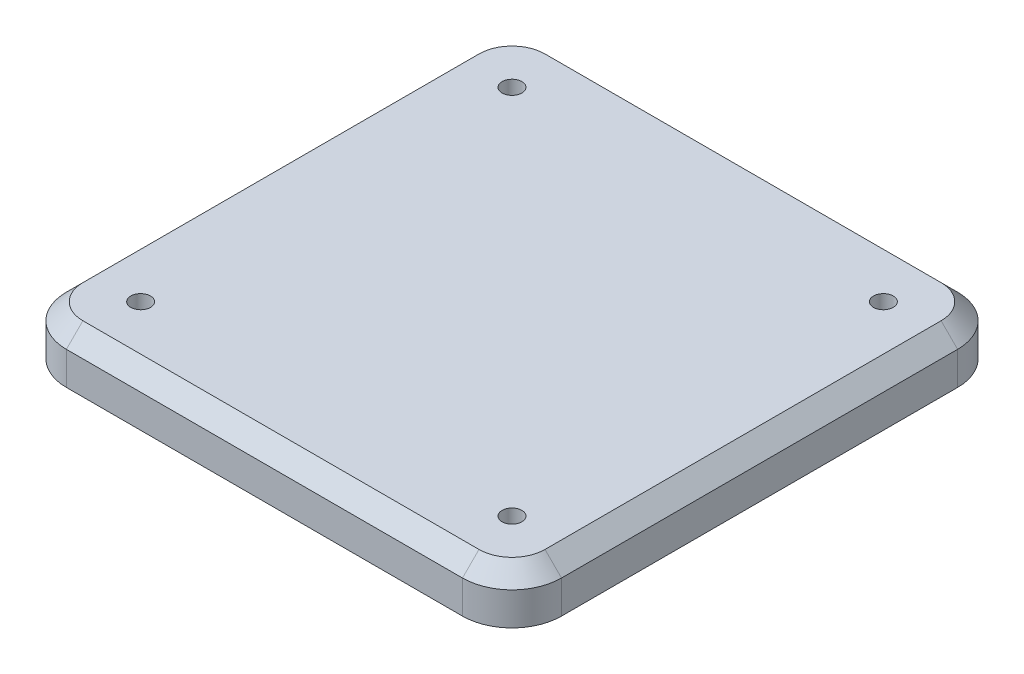
ISO-10303-21;
HEADER;
FILE_DESCRIPTION(('STEP AP214'),'2;1');
FILE_NAME('part.step','',(''),(''),'','','');
FILE_SCHEMA(('AUTOMOTIVE_DESIGN { 1 0 10303 214 1 1 1 1 }'));
ENDSEC;
DATA;
#1=APPLICATION_CONTEXT('core data for automotive mechanical design processes');
#2=APPLICATION_PROTOCOL_DEFINITION('international standard','automotive_design',2000,#1);
#3=PRODUCT_CONTEXT('',#1,'mechanical');
#4=PRODUCT('Part','Part','',(#3));
#5=PRODUCT_RELATED_PRODUCT_CATEGORY('part','',(#4));
#6=PRODUCT_DEFINITION_FORMATION('','',#4);
#7=PRODUCT_DEFINITION_CONTEXT('part definition',#1,'design');
#8=PRODUCT_DEFINITION('design','',#6,#7);
#9=PRODUCT_DEFINITION_SHAPE('','',#8);
#10=(LENGTH_UNIT() NAMED_UNIT(*) SI_UNIT(.MILLI.,.METRE.));
#11=(NAMED_UNIT(*) PLANE_ANGLE_UNIT() SI_UNIT($,.RADIAN.));
#12=(NAMED_UNIT(*) SI_UNIT($,.STERADIAN.) SOLID_ANGLE_UNIT());
#13=UNCERTAINTY_MEASURE_WITH_UNIT(LENGTH_MEASURE(1.E-05),#10,'distance_accuracy_value','');
#14=(GEOMETRIC_REPRESENTATION_CONTEXT(3) GLOBAL_UNCERTAINTY_ASSIGNED_CONTEXT((#13)) GLOBAL_UNIT_ASSIGNED_CONTEXT((#10,
#11,#12)) REPRESENTATION_CONTEXT('',''));
#15=CARTESIAN_POINT('',(0.,0.,0.));
#16=DIRECTION('',(0.,0.,1.));
#17=DIRECTION('',(1.,0.,0.));
#18=AXIS2_PLACEMENT_3D('',#15,#16,#17);
#19=CARTESIAN_POINT('',(150.,30.,150.));
#20=DIRECTION('',(-1.,0.,0.));
#21=DIRECTION('',(0.,0.,1.));
#22=AXIS2_PLACEMENT_3D('',#19,#20,#21);
#23=PLANE('',#22);
#24=DIRECTION('',(0.,-1.,0.));
#25=VECTOR('',#24,1.);
#26=CARTESIAN_POINT('',(150.,30.,-120.));
#27=LINE('',#26,#25);
#28=CARTESIAN_POINT('',(150.,0.,-120.));
#29=VERTEX_POINT('',#28);
#30=CARTESIAN_POINT('',(150.,20.,-120.));
#31=VERTEX_POINT('',#30);
#32=EDGE_CURVE('E164',#29,#31,#27,.F.);
#33=ORIENTED_EDGE('',*,*,#32,.T.);
#34=DIRECTION('',(0.,0.,1.));
#35=VECTOR('',#34,1.);
#36=CARTESIAN_POINT('',(150.,20.,150.));
#37=LINE('',#36,#35);
#38=CARTESIAN_POINT('',(150.,20.,120.));
#39=VERTEX_POINT('',#38);
#40=EDGE_CURVE('E192',#31,#39,#37,.T.);
#41=ORIENTED_EDGE('',*,*,#40,.T.);
#42=DIRECTION('',(0.,-1.,0.));
#43=VECTOR('',#42,1.);
#44=CARTESIAN_POINT('',(150.,30.,120.));
#45=LINE('',#44,#43);
#46=CARTESIAN_POINT('',(150.,0.,120.));
#47=VERTEX_POINT('',#46);
#48=EDGE_CURVE('E162',#39,#47,#45,.T.);
#49=ORIENTED_EDGE('',*,*,#48,.T.);
#50=DIRECTION('',(0.,0.,-1.));
#51=VECTOR('',#50,1.);
#52=CARTESIAN_POINT('',(150.,0.,150.));
#53=LINE('',#52,#51);
#54=EDGE_CURVE('E151',#47,#29,#53,.T.);
#55=ORIENTED_EDGE('',*,*,#54,.T.);
#56=EDGE_LOOP('',(#33,#41,#49,#55));
#57=FACE_BOUND('',#56,.T.);
#58=ADVANCED_FACE('F34',(#57),#23,.F.);
#59=CARTESIAN_POINT('',(-150.,30.,-150.));
#60=DIRECTION('',(0.,0.,1.));
#61=DIRECTION('',(1.,0.,0.));
#62=AXIS2_PLACEMENT_3D('',#59,#60,#61);
#63=PLANE('',#62);
#64=DIRECTION('',(0.,-1.,0.));
#65=VECTOR('',#64,1.);
#66=CARTESIAN_POINT('',(-120.,30.,-150.));
#67=LINE('',#66,#65);
#68=CARTESIAN_POINT('',(-120.,0.,-150.));
#69=VERTEX_POINT('',#68);
#70=CARTESIAN_POINT('',(-120.,20.,-150.));
#71=VERTEX_POINT('',#70);
#72=EDGE_CURVE('E136',#69,#71,#67,.F.);
#73=ORIENTED_EDGE('',*,*,#72,.T.);
#74=DIRECTION('',(1.,0.,0.));
#75=VECTOR('',#74,1.);
#76=CARTESIAN_POINT('',(-150.,20.,-150.));
#77=LINE('',#76,#75);
#78=CARTESIAN_POINT('',(120.,20.,-150.));
#79=VERTEX_POINT('',#78);
#80=EDGE_CURVE('E11',#71,#79,#77,.T.);
#81=ORIENTED_EDGE('',*,*,#80,.T.);
#82=DIRECTION('',(0.,-1.,0.));
#83=VECTOR('',#82,1.);
#84=CARTESIAN_POINT('',(120.,30.,-150.));
#85=LINE('',#84,#83);
#86=CARTESIAN_POINT('',(120.,0.,-150.));
#87=VERTEX_POINT('',#86);
#88=EDGE_CURVE('E140',#79,#87,#85,.T.);
#89=ORIENTED_EDGE('',*,*,#88,.T.);
#90=DIRECTION('',(-1.,0.,0.));
#91=VECTOR('',#90,1.);
#92=CARTESIAN_POINT('',(-150.,0.,-150.));
#93=LINE('',#92,#91);
#94=EDGE_CURVE('E147',#87,#69,#93,.T.);
#95=ORIENTED_EDGE('',*,*,#94,.T.);
#96=EDGE_LOOP('',(#73,#81,#89,#95));
#97=FACE_BOUND('',#96,.T.);
#98=ADVANCED_FACE('F339',(#97),#63,.F.);
#99=CARTESIAN_POINT('',(-150.,30.,150.));
#100=DIRECTION('',(1.,0.,0.));
#101=DIRECTION('',(0.,0.,-1.));
#102=AXIS2_PLACEMENT_3D('',#99,#100,#101);
#103=PLANE('',#102);
#104=DIRECTION('',(0.,-1.,0.));
#105=VECTOR('',#104,1.);
#106=CARTESIAN_POINT('',(-150.,30.,120.));
#107=LINE('',#106,#105);
#108=CARTESIAN_POINT('',(-150.,0.,120.));
#109=VERTEX_POINT('',#108);
#110=CARTESIAN_POINT('',(-150.,20.,120.));
#111=VERTEX_POINT('',#110);
#112=EDGE_CURVE('E132',#109,#111,#107,.F.);
#113=ORIENTED_EDGE('',*,*,#112,.T.);
#114=DIRECTION('',(0.,0.,-1.));
#115=VECTOR('',#114,1.);
#116=CARTESIAN_POINT('',(-150.,20.,150.));
#117=LINE('',#116,#115);
#118=CARTESIAN_POINT('',(-150.,20.,-120.));
#119=VERTEX_POINT('',#118);
#120=EDGE_CURVE('E59',#111,#119,#117,.T.);
#121=ORIENTED_EDGE('',*,*,#120,.T.);
#122=DIRECTION('',(0.,-1.,0.));
#123=VECTOR('',#122,1.);
#124=CARTESIAN_POINT('',(-150.,30.,-120.));
#125=LINE('',#124,#123);
#126=CARTESIAN_POINT('',(-150.,0.,-120.));
#127=VERTEX_POINT('',#126);
#128=EDGE_CURVE('E124',#119,#127,#125,.T.);
#129=ORIENTED_EDGE('',*,*,#128,.T.);
#130=DIRECTION('',(0.,0.,1.));
#131=VECTOR('',#130,1.);
#132=CARTESIAN_POINT('',(-150.,0.,150.));
#133=LINE('',#132,#131);
#134=EDGE_CURVE('E128',#127,#109,#133,.T.);
#135=ORIENTED_EDGE('',*,*,#134,.T.);
#136=EDGE_LOOP('',(#113,#121,#129,#135));
#137=FACE_BOUND('',#136,.T.);
#138=ADVANCED_FACE('F126',(#137),#103,.F.);
#139=CARTESIAN_POINT('',(-150.,30.,150.));
#140=DIRECTION('',(0.,0.,-1.));
#141=DIRECTION('',(-1.,0.,0.));
#142=AXIS2_PLACEMENT_3D('',#139,#140,#141);
#143=PLANE('',#142);
#144=DIRECTION('',(0.,-1.,0.));
#145=VECTOR('',#144,1.);
#146=CARTESIAN_POINT('',(120.,30.,150.));
#147=LINE('',#146,#145);
#148=CARTESIAN_POINT('',(120.,0.,150.));
#149=VERTEX_POINT('',#148);
#150=CARTESIAN_POINT('',(120.,20.,150.));
#151=VERTEX_POINT('',#150);
#152=EDGE_CURVE('E169',#149,#151,#147,.F.);
#153=ORIENTED_EDGE('',*,*,#152,.T.);
#154=DIRECTION('',(-1.,0.,0.));
#155=VECTOR('',#154,1.);
#156=CARTESIAN_POINT('',(-150.,20.,150.));
#157=LINE('',#156,#155);
#158=CARTESIAN_POINT('',(-120.,20.,150.));
#159=VERTEX_POINT('',#158);
#160=EDGE_CURVE('E196',#151,#159,#157,.T.);
#161=ORIENTED_EDGE('',*,*,#160,.T.);
#162=DIRECTION('',(0.,-1.,0.));
#163=VECTOR('',#162,1.);
#164=CARTESIAN_POINT('',(-120.,30.,150.));
#165=LINE('',#164,#163);
#166=CARTESIAN_POINT('',(-120.,0.,150.));
#167=VERTEX_POINT('',#166);
#168=EDGE_CURVE('E167',#159,#167,#165,.T.);
#169=ORIENTED_EDGE('',*,*,#168,.T.);
#170=DIRECTION('',(1.,0.,0.));
#171=VECTOR('',#170,1.);
#172=CARTESIAN_POINT('',(-150.,0.,150.));
#173=LINE('',#172,#171);
#174=EDGE_CURVE('E146',#167,#149,#173,.T.);
#175=ORIENTED_EDGE('',*,*,#174,.T.);
#176=EDGE_LOOP('',(#153,#161,#169,#175));
#177=FACE_BOUND('',#176,.T.);
#178=ADVANCED_FACE('F293',(#177),#143,.F.);
#179=CARTESIAN_POINT('',(0.,30.,0.));
#180=DIRECTION('',(0.,-1.,0.));
#181=DIRECTION('',(0.,0.,-1.));
#182=AXIS2_PLACEMENT_3D('',#179,#180,#181);
#183=PLANE('',#182);
#184=CARTESIAN_POINT('',(-112.5,30.,112.5));
#185=DIRECTION('',(0.,1.,0.));
#186=DIRECTION('',(0.,0.,1.));
#187=AXIS2_PLACEMENT_3D('',#184,#185,#186);
#188=CIRCLE('',#187,6.);
#189=CARTESIAN_POINT('',(-112.5,30.,118.5));
#190=VERTEX_POINT('',#189);
#191=EDGE_CURVE('E263',#190,#190,#188,.T.);
#192=ORIENTED_EDGE('',*,*,#191,.F.);
#193=EDGE_LOOP('',(#192));
#194=FACE_BOUND('',#193,.T.);
#195=CARTESIAN_POINT('',(-112.5,30.,-112.5));
#196=DIRECTION('',(0.,1.,0.));
#197=DIRECTION('',(0.,0.,1.));
#198=AXIS2_PLACEMENT_3D('',#195,#196,#197);
#199=CIRCLE('',#198,6.);
#200=CARTESIAN_POINT('',(-112.5,30.,-106.5));
#201=VERTEX_POINT('',#200);
#202=EDGE_CURVE('E269',#201,#201,#199,.T.);
#203=ORIENTED_EDGE('',*,*,#202,.F.);
#204=EDGE_LOOP('',(#203));
#205=FACE_BOUND('',#204,.T.);
#206=CARTESIAN_POINT('',(112.5,30.,-112.5));
#207=DIRECTION('',(0.,1.,0.));
#208=DIRECTION('',(0.,0.,1.));
#209=AXIS2_PLACEMENT_3D('',#206,#207,#208);
#210=CIRCLE('',#209,6.);
#211=CARTESIAN_POINT('',(112.5,30.,-106.5));
#212=VERTEX_POINT('',#211);
#213=EDGE_CURVE('E275',#212,#212,#210,.T.);
#214=ORIENTED_EDGE('',*,*,#213,.F.);
#215=EDGE_LOOP('',(#214));
#216=FACE_BOUND('',#215,.T.);
#217=CARTESIAN_POINT('',(112.5,30.,112.5));
#218=DIRECTION('',(0.,1.,0.));
#219=DIRECTION('',(0.,0.,1.));
#220=AXIS2_PLACEMENT_3D('',#217,#218,#219);
#221=CIRCLE('',#220,6.);
#222=CARTESIAN_POINT('',(112.5,30.,118.5));
#223=VERTEX_POINT('',#222);
#224=EDGE_CURVE('E257',#223,#223,#221,.T.);
#225=ORIENTED_EDGE('',*,*,#224,.F.);
#226=EDGE_LOOP('',(#225));
#227=FACE_BOUND('',#226,.T.);
#228=DIRECTION('',(0.,0.,-1.));
#229=VECTOR('',#228,1.);
#230=CARTESIAN_POINT('',(140.,30.,0.));
#231=LINE('',#230,#229);
#232=CARTESIAN_POINT('',(140.,30.,120.));
#233=VERTEX_POINT('',#232);
#234=CARTESIAN_POINT('',(140.,30.,-120.));
#235=VERTEX_POINT('',#234);
#236=EDGE_CURVE('E184',#233,#235,#231,.T.);
#237=ORIENTED_EDGE('',*,*,#236,.T.);
#238=CARTESIAN_POINT('',(120.,30.,-120.));
#239=DIRECTION('',(0.,-1.,0.));
#240=DIRECTION('',(0.,0.,-1.));
#241=AXIS2_PLACEMENT_3D('',#238,#239,#240);
#242=CIRCLE('',#241,20.);
#243=CARTESIAN_POINT('',(120.,30.,-140.));
#244=VERTEX_POINT('',#243);
#245=EDGE_CURVE('E186',#235,#244,#242,.F.);
#246=ORIENTED_EDGE('',*,*,#245,.T.);
#247=DIRECTION('',(-1.,0.,0.));
#248=VECTOR('',#247,1.);
#249=CARTESIAN_POINT('',(0.,30.,-140.));
#250=LINE('',#249,#248);
#251=CARTESIAN_POINT('',(-120.,30.,-140.));
#252=VERTEX_POINT('',#251);
#253=EDGE_CURVE('E172',#244,#252,#250,.T.);
#254=ORIENTED_EDGE('',*,*,#253,.T.);
#255=CARTESIAN_POINT('',(-120.,30.,-120.));
#256=DIRECTION('',(0.,-1.,0.));
#257=DIRECTION('',(0.,0.,-1.));
#258=AXIS2_PLACEMENT_3D('',#255,#256,#257);
#259=CIRCLE('',#258,20.);
#260=CARTESIAN_POINT('',(-140.,30.,-120.));
#261=VERTEX_POINT('',#260);
#262=EDGE_CURVE('E174',#252,#261,#259,.F.);
#263=ORIENTED_EDGE('',*,*,#262,.T.);
#264=DIRECTION('',(0.,0.,1.));
#265=VECTOR('',#264,1.);
#266=CARTESIAN_POINT('',(-140.,30.,0.));
#267=LINE('',#266,#265);
#268=CARTESIAN_POINT('',(-140.,30.,120.));
#269=VERTEX_POINT('',#268);
#270=EDGE_CURVE('E176',#261,#269,#267,.T.);
#271=ORIENTED_EDGE('',*,*,#270,.T.);
#272=CARTESIAN_POINT('',(-120.,30.,120.));
#273=DIRECTION('',(0.,-1.,0.));
#274=DIRECTION('',(0.,0.,-1.));
#275=AXIS2_PLACEMENT_3D('',#272,#273,#274);
#276=CIRCLE('',#275,20.);
#277=CARTESIAN_POINT('',(-120.,30.,140.));
#278=VERTEX_POINT('',#277);
#279=EDGE_CURVE('E178',#269,#278,#276,.F.);
#280=ORIENTED_EDGE('',*,*,#279,.T.);
#281=DIRECTION('',(1.,0.,0.));
#282=VECTOR('',#281,1.);
#283=CARTESIAN_POINT('',(0.,30.,140.));
#284=LINE('',#283,#282);
#285=CARTESIAN_POINT('',(120.,30.,140.));
#286=VERTEX_POINT('',#285);
#287=EDGE_CURVE('E180',#278,#286,#284,.T.);
#288=ORIENTED_EDGE('',*,*,#287,.T.);
#289=CARTESIAN_POINT('',(120.,30.,120.));
#290=DIRECTION('',(0.,-1.,0.));
#291=DIRECTION('',(0.,0.,-1.));
#292=AXIS2_PLACEMENT_3D('',#289,#290,#291);
#293=CIRCLE('',#292,20.);
#294=EDGE_CURVE('E182',#286,#233,#293,.F.);
#295=ORIENTED_EDGE('',*,*,#294,.T.);
#296=EDGE_LOOP('',(#237,#246,#254,#263,#271,#280,#288,#295));
#297=FACE_BOUND('',#296,.T.);
#298=ADVANCED_FACE('F290',(#194,#205,#216,#227,#297),#183,.F.);
#299=CARTESIAN_POINT('',(0.,0.,0.));
#300=DIRECTION('',(0.,-1.,0.));
#301=DIRECTION('',(0.,0.,-1.));
#302=AXIS2_PLACEMENT_3D('',#299,#300,#301);
#303=PLANE('',#302);
#304=CARTESIAN_POINT('',(-125.,0.,-125.));
#305=DIRECTION('',(0.,-1.,0.));
#306=DIRECTION('',(0.,0.,-1.));
#307=AXIS2_PLACEMENT_3D('',#304,#305,#306);
#308=CIRCLE('',#307,6.);
#309=CARTESIAN_POINT('',(-125.,0.,-131.));
#310=VERTEX_POINT('',#309);
#311=EDGE_CURVE('E239',#310,#310,#308,.T.);
#312=ORIENTED_EDGE('',*,*,#311,.F.);
#313=EDGE_LOOP('',(#312));
#314=FACE_BOUND('',#313,.T.);
#315=CARTESIAN_POINT('',(-125.,0.,125.));
#316=DIRECTION('',(0.,-1.,0.));
#317=DIRECTION('',(0.,0.,-1.));
#318=AXIS2_PLACEMENT_3D('',#315,#316,#317);
#319=CIRCLE('',#318,6.);
#320=CARTESIAN_POINT('',(-125.,0.,119.));
#321=VERTEX_POINT('',#320);
#322=EDGE_CURVE('E246',#321,#321,#319,.T.);
#323=ORIENTED_EDGE('',*,*,#322,.F.);
#324=EDGE_LOOP('',(#323));
#325=FACE_BOUND('',#324,.T.);
#326=CARTESIAN_POINT('',(125.,0.,125.));
#327=DIRECTION('',(0.,-1.,0.));
#328=DIRECTION('',(0.,0.,-1.));
#329=AXIS2_PLACEMENT_3D('',#326,#327,#328);
#330=CIRCLE('',#329,6.00000000000007);
#331=CARTESIAN_POINT('',(125.,0.,119.));
#332=VERTEX_POINT('',#331);
#333=EDGE_CURVE('E252',#332,#332,#330,.T.);
#334=ORIENTED_EDGE('',*,*,#333,.F.);
#335=EDGE_LOOP('',(#334));
#336=FACE_BOUND('',#335,.T.);
#337=CARTESIAN_POINT('',(125.,0.,-125.));
#338=DIRECTION('',(0.,-1.,0.));
#339=DIRECTION('',(0.,0.,-1.));
#340=AXIS2_PLACEMENT_3D('',#337,#338,#339);
#341=CIRCLE('',#340,6.00000000000007);
#342=CARTESIAN_POINT('',(125.,0.,-131.));
#343=VERTEX_POINT('',#342);
#344=EDGE_CURVE('E233',#343,#343,#341,.T.);
#345=ORIENTED_EDGE('',*,*,#344,.F.);
#346=EDGE_LOOP('',(#345));
#347=FACE_BOUND('',#346,.T.);
#348=ORIENTED_EDGE('',*,*,#134,.F.);
#349=CARTESIAN_POINT('',(-120.,0.,-120.));
#350=DIRECTION('',(0.,-1.,0.));
#351=DIRECTION('',(0.,0.,-1.));
#352=AXIS2_PLACEMENT_3D('',#349,#350,#351);
#353=CIRCLE('',#352,30.);
#354=EDGE_CURVE('E134',#127,#69,#353,.T.);
#355=ORIENTED_EDGE('',*,*,#354,.T.);
#356=ORIENTED_EDGE('',*,*,#94,.F.);
#357=CARTESIAN_POINT('',(120.,0.,-120.));
#358=DIRECTION('',(0.,-1.,0.));
#359=DIRECTION('',(0.,0.,-1.));
#360=AXIS2_PLACEMENT_3D('',#357,#358,#359);
#361=CIRCLE('',#360,30.);
#362=EDGE_CURVE('E141',#87,#29,#361,.T.);
#363=ORIENTED_EDGE('',*,*,#362,.T.);
#364=ORIENTED_EDGE('',*,*,#54,.F.);
#365=CARTESIAN_POINT('',(120.,0.,120.));
#366=DIRECTION('',(0.,-1.,0.));
#367=DIRECTION('',(0.,0.,-1.));
#368=AXIS2_PLACEMENT_3D('',#365,#366,#367);
#369=CIRCLE('',#368,30.);
#370=EDGE_CURVE('E157',#47,#149,#369,.T.);
#371=ORIENTED_EDGE('',*,*,#370,.T.);
#372=ORIENTED_EDGE('',*,*,#174,.F.);
#373=CARTESIAN_POINT('',(-120.,0.,120.));
#374=DIRECTION('',(0.,-1.,0.));
#375=DIRECTION('',(0.,0.,-1.));
#376=AXIS2_PLACEMENT_3D('',#373,#374,#375);
#377=CIRCLE('',#376,30.);
#378=EDGE_CURVE('E131',#167,#109,#377,.T.);
#379=ORIENTED_EDGE('',*,*,#378,.T.);
#380=EDGE_LOOP('',(#348,#355,#356,#363,#364,#371,#372,#379));
#381=FACE_BOUND('',#380,.T.);
#382=ADVANCED_FACE('F143',(#314,#325,#336,#347,#381),#303,.T.);
#383=CARTESIAN_POINT('',(-120.,30.,-120.));
#384=DIRECTION('',(0.,-1.,0.));
#385=DIRECTION('',(0.,0.,-1.));
#386=AXIS2_PLACEMENT_3D('',#383,#384,#385);
#387=CYLINDRICAL_SURFACE('',#386,30.);
#388=ORIENTED_EDGE('',*,*,#128,.F.);
#389=CARTESIAN_POINT('',(-120.,20.,-120.));
#390=DIRECTION('',(0.,-1.,0.));
#391=DIRECTION('',(0.,0.,-1.));
#392=AXIS2_PLACEMENT_3D('',#389,#390,#391);
#393=CIRCLE('',#392,30.);
#394=EDGE_CURVE('E44',#119,#71,#393,.T.);
#395=ORIENTED_EDGE('',*,*,#394,.T.);
#396=ORIENTED_EDGE('',*,*,#72,.F.);
#397=ORIENTED_EDGE('',*,*,#354,.F.);
#398=EDGE_LOOP('',(#388,#395,#396,#397));
#399=FACE_BOUND('',#398,.T.);
#400=ADVANCED_FACE('F135',(#399),#387,.T.);
#401=CARTESIAN_POINT('',(120.,30.,-120.));
#402=DIRECTION('',(0.,-1.,0.));
#403=DIRECTION('',(0.,0.,-1.));
#404=AXIS2_PLACEMENT_3D('',#401,#402,#403);
#405=CYLINDRICAL_SURFACE('',#404,30.);
#406=ORIENTED_EDGE('',*,*,#88,.F.);
#407=CARTESIAN_POINT('',(120.,20.,-120.));
#408=DIRECTION('',(0.,-1.,0.));
#409=DIRECTION('',(0.,0.,-1.));
#410=AXIS2_PLACEMENT_3D('',#407,#408,#409);
#411=CIRCLE('',#410,30.);
#412=EDGE_CURVE('E189',#79,#31,#411,.T.);
#413=ORIENTED_EDGE('',*,*,#412,.T.);
#414=ORIENTED_EDGE('',*,*,#32,.F.);
#415=ORIENTED_EDGE('',*,*,#362,.F.);
#416=EDGE_LOOP('',(#406,#413,#414,#415));
#417=FACE_BOUND('',#416,.T.);
#418=ADVANCED_FACE('F337',(#417),#405,.T.);
#419=CARTESIAN_POINT('',(120.,30.,120.));
#420=DIRECTION('',(0.,-1.,0.));
#421=DIRECTION('',(0.,0.,-1.));
#422=AXIS2_PLACEMENT_3D('',#419,#420,#421);
#423=CYLINDRICAL_SURFACE('',#422,30.);
#424=ORIENTED_EDGE('',*,*,#48,.F.);
#425=CARTESIAN_POINT('',(120.,20.,120.));
#426=DIRECTION('',(0.,-1.,0.));
#427=DIRECTION('',(0.,0.,-1.));
#428=AXIS2_PLACEMENT_3D('',#425,#426,#427);
#429=CIRCLE('',#428,30.);
#430=EDGE_CURVE('E194',#39,#151,#429,.T.);
#431=ORIENTED_EDGE('',*,*,#430,.T.);
#432=ORIENTED_EDGE('',*,*,#152,.F.);
#433=ORIENTED_EDGE('',*,*,#370,.F.);
#434=EDGE_LOOP('',(#424,#431,#432,#433));
#435=FACE_BOUND('',#434,.T.);
#436=ADVANCED_FACE('F330',(#435),#423,.T.);
#437=CARTESIAN_POINT('',(-120.,30.,120.));
#438=DIRECTION('',(0.,-1.,0.));
#439=DIRECTION('',(0.,0.,-1.));
#440=AXIS2_PLACEMENT_3D('',#437,#438,#439);
#441=CYLINDRICAL_SURFACE('',#440,30.);
#442=ORIENTED_EDGE('',*,*,#168,.F.);
#443=CARTESIAN_POINT('',(-120.,20.,120.));
#444=DIRECTION('',(0.,-1.,0.));
#445=DIRECTION('',(0.,0.,-1.));
#446=AXIS2_PLACEMENT_3D('',#443,#444,#445);
#447=CIRCLE('',#446,30.);
#448=EDGE_CURVE('E198',#159,#111,#447,.T.);
#449=ORIENTED_EDGE('',*,*,#448,.T.);
#450=ORIENTED_EDGE('',*,*,#112,.F.);
#451=ORIENTED_EDGE('',*,*,#378,.F.);
#452=EDGE_LOOP('',(#442,#449,#450,#451));
#453=FACE_BOUND('',#452,.T.);
#454=ADVANCED_FACE('F354',(#453),#441,.T.);
#455=CARTESIAN_POINT('',(-120.,30.,120.));
#456=DIRECTION('',(0.,-1.,0.));
#457=DIRECTION('',(0.,0.,-1.));
#458=AXIS2_PLACEMENT_3D('',#455,#456,#457);
#459=CONICAL_SURFACE('',#458,20.,0.785398163397448);
#460=DIRECTION('',(0.707106781186547,0.707106781186547,0.));
#461=VECTOR('',#460,1.);
#462=CARTESIAN_POINT('',(-150.,20.,120.));
#463=LINE('',#462,#461);
#464=EDGE_CURVE('E218',#111,#269,#463,.T.);
#465=ORIENTED_EDGE('',*,*,#464,.F.);
#466=ORIENTED_EDGE('',*,*,#448,.F.);
#467=DIRECTION('',(0.,-0.707106781186547,0.707106781186547));
#468=VECTOR('',#467,1.);
#469=CARTESIAN_POINT('',(-120.,30.,140.));
#470=LINE('',#469,#468);
#471=EDGE_CURVE('E39',#278,#159,#470,.T.);
#472=ORIENTED_EDGE('',*,*,#471,.F.);
#473=ORIENTED_EDGE('',*,*,#279,.F.);
#474=EDGE_LOOP('',(#465,#466,#472,#473));
#475=FACE_BOUND('',#474,.T.);
#476=ADVANCED_FACE('F37',(#475),#459,.T.);
#477=CARTESIAN_POINT('',(0.,30.,140.));
#478=DIRECTION('',(0.,-0.707106781186547,-0.707106781186547));
#479=DIRECTION('',(1.,0.,0.));
#480=AXIS2_PLACEMENT_3D('',#477,#478,#479);
#481=PLANE('',#480);
#482=ORIENTED_EDGE('',*,*,#471,.T.);
#483=ORIENTED_EDGE('',*,*,#160,.F.);
#484=DIRECTION('',(0.,-0.707106781186547,0.707106781186547));
#485=VECTOR('',#484,1.);
#486=CARTESIAN_POINT('',(120.,30.,140.));
#487=LINE('',#486,#485);
#488=EDGE_CURVE('E216',#286,#151,#487,.T.);
#489=ORIENTED_EDGE('',*,*,#488,.F.);
#490=ORIENTED_EDGE('',*,*,#287,.F.);
#491=EDGE_LOOP('',(#482,#483,#489,#490));
#492=FACE_BOUND('',#491,.T.);
#493=ADVANCED_FACE('F323',(#492),#481,.F.);
#494=CARTESIAN_POINT('',(-140.,30.,0.));
#495=DIRECTION('',(0.707106781186547,-0.707106781186547,0.));
#496=DIRECTION('',(0.,0.,1.));
#497=AXIS2_PLACEMENT_3D('',#494,#495,#496);
#498=PLANE('',#497);
#499=ORIENTED_EDGE('',*,*,#464,.T.);
#500=ORIENTED_EDGE('',*,*,#270,.F.);
#501=DIRECTION('',(0.707106781186547,0.707106781186547,0.));
#502=VECTOR('',#501,1.);
#503=CARTESIAN_POINT('',(-150.,20.,-120.));
#504=LINE('',#503,#502);
#505=EDGE_CURVE('E213',#119,#261,#504,.T.);
#506=ORIENTED_EDGE('',*,*,#505,.F.);
#507=ORIENTED_EDGE('',*,*,#120,.F.);
#508=EDGE_LOOP('',(#499,#500,#506,#507));
#509=FACE_BOUND('',#508,.T.);
#510=ADVANCED_FACE('F318',(#509),#498,.F.);
#511=CARTESIAN_POINT('',(120.,30.,120.));
#512=DIRECTION('',(0.,-1.,0.));
#513=DIRECTION('',(0.,0.,-1.));
#514=AXIS2_PLACEMENT_3D('',#511,#512,#513);
#515=CONICAL_SURFACE('',#514,20.,0.785398163397448);
#516=ORIENTED_EDGE('',*,*,#488,.T.);
#517=ORIENTED_EDGE('',*,*,#430,.F.);
#518=DIRECTION('',(0.707106781186547,-0.707106781186547,0.));
#519=VECTOR('',#518,1.);
#520=CARTESIAN_POINT('',(140.,30.,120.));
#521=LINE('',#520,#519);
#522=EDGE_CURVE('E210',#233,#39,#521,.T.);
#523=ORIENTED_EDGE('',*,*,#522,.F.);
#524=ORIENTED_EDGE('',*,*,#294,.F.);
#525=EDGE_LOOP('',(#516,#517,#523,#524));
#526=FACE_BOUND('',#525,.T.);
#527=ADVANCED_FACE('F326',(#526),#515,.T.);
#528=CARTESIAN_POINT('',(-120.,30.,-120.));
#529=DIRECTION('',(0.,-1.,0.));
#530=DIRECTION('',(0.,0.,-1.));
#531=AXIS2_PLACEMENT_3D('',#528,#529,#530);
#532=CONICAL_SURFACE('',#531,20.,0.785398163397448);
#533=ORIENTED_EDGE('',*,*,#505,.T.);
#534=ORIENTED_EDGE('',*,*,#262,.F.);
#535=DIRECTION('',(0.,0.707106781186547,0.707106781186547));
#536=VECTOR('',#535,1.);
#537=CARTESIAN_POINT('',(-120.,20.,-150.));
#538=LINE('',#537,#536);
#539=EDGE_CURVE('E207',#71,#252,#538,.T.);
#540=ORIENTED_EDGE('',*,*,#539,.F.);
#541=ORIENTED_EDGE('',*,*,#394,.F.);
#542=EDGE_LOOP('',(#533,#534,#540,#541));
#543=FACE_BOUND('',#542,.T.);
#544=ADVANCED_FACE('F317',(#543),#532,.T.);
#545=CARTESIAN_POINT('',(140.,30.,0.));
#546=DIRECTION('',(-0.707106781186547,-0.707106781186547,0.));
#547=DIRECTION('',(0.,0.,-1.));
#548=AXIS2_PLACEMENT_3D('',#545,#546,#547);
#549=PLANE('',#548);
#550=ORIENTED_EDGE('',*,*,#522,.T.);
#551=ORIENTED_EDGE('',*,*,#40,.F.);
#552=DIRECTION('',(0.707106781186547,-0.707106781186547,0.));
#553=VECTOR('',#552,1.);
#554=CARTESIAN_POINT('',(140.,30.,-120.));
#555=LINE('',#554,#553);
#556=EDGE_CURVE('E204',#235,#31,#555,.T.);
#557=ORIENTED_EDGE('',*,*,#556,.F.);
#558=ORIENTED_EDGE('',*,*,#236,.F.);
#559=EDGE_LOOP('',(#550,#551,#557,#558));
#560=FACE_BOUND('',#559,.T.);
#561=ADVANCED_FACE('F305',(#560),#549,.F.);
#562=CARTESIAN_POINT('',(0.,30.,-140.));
#563=DIRECTION('',(0.,-0.707106781186547,0.707106781186547));
#564=DIRECTION('',(-1.,0.,0.));
#565=AXIS2_PLACEMENT_3D('',#562,#563,#564);
#566=PLANE('',#565);
#567=ORIENTED_EDGE('',*,*,#539,.T.);
#568=ORIENTED_EDGE('',*,*,#253,.F.);
#569=DIRECTION('',(0.,0.707106781186547,0.707106781186547));
#570=VECTOR('',#569,1.);
#571=CARTESIAN_POINT('',(120.,20.,-150.));
#572=LINE('',#571,#570);
#573=EDGE_CURVE('E202',#79,#244,#572,.T.);
#574=ORIENTED_EDGE('',*,*,#573,.F.);
#575=ORIENTED_EDGE('',*,*,#80,.F.);
#576=EDGE_LOOP('',(#567,#568,#574,#575));
#577=FACE_BOUND('',#576,.T.);
#578=ADVANCED_FACE('F313',(#577),#566,.F.);
#579=CARTESIAN_POINT('',(120.,30.,-120.));
#580=DIRECTION('',(0.,-1.,0.));
#581=DIRECTION('',(0.,0.,-1.));
#582=AXIS2_PLACEMENT_3D('',#579,#580,#581);
#583=CONICAL_SURFACE('',#582,20.,0.785398163397448);
#584=ORIENTED_EDGE('',*,*,#556,.T.);
#585=ORIENTED_EDGE('',*,*,#412,.F.);
#586=ORIENTED_EDGE('',*,*,#573,.T.);
#587=ORIENTED_EDGE('',*,*,#245,.F.);
#588=EDGE_LOOP('',(#584,#585,#586,#587));
#589=FACE_BOUND('',#588,.T.);
#590=ADVANCED_FACE('F308',(#589),#583,.T.);
#591=CARTESIAN_POINT('',(125.,10.,-125.));
#592=DIRECTION('',(0.,-1.,0.));
#593=DIRECTION('',(0.,0.,-1.));
#594=AXIS2_PLACEMENT_3D('',#591,#592,#593);
#595=CYLINDRICAL_SURFACE('',#594,6.00000000000007);
#596=CARTESIAN_POINT('',(125.,10.,-125.));
#597=DIRECTION('',(0.,-1.,0.));
#598=DIRECTION('',(0.,0.,-1.));
#599=AXIS2_PLACEMENT_3D('',#596,#597,#598);
#600=CIRCLE('',#599,6.00000000000007);
#601=CARTESIAN_POINT('',(125.,10.,-131.));
#602=VERTEX_POINT('',#601);
#603=EDGE_CURVE('E205',#602,#602,#600,.T.);
#604=ORIENTED_EDGE('',*,*,#603,.F.);
#605=EDGE_LOOP('',(#604));
#606=FACE_BOUND('',#605,.T.);
#607=ORIENTED_EDGE('',*,*,#344,.T.);
#608=EDGE_LOOP('',(#607));
#609=FACE_BOUND('',#608,.T.);
#610=ADVANCED_FACE('F364',(#606,#609),#595,.F.);
#611=CARTESIAN_POINT('',(125.,10.,-125.));
#612=DIRECTION('',(0.,-1.,0.));
#613=DIRECTION('',(0.,0.,-1.));
#614=AXIS2_PLACEMENT_3D('',#611,#612,#613);
#615=PLANE('',#614);
#616=ORIENTED_EDGE('',*,*,#603,.T.);
#617=EDGE_LOOP('',(#616));
#618=FACE_BOUND('',#617,.T.);
#619=ADVANCED_FACE('F507',(#618),#615,.T.);
#620=CARTESIAN_POINT('',(125.,10.,125.));
#621=DIRECTION('',(0.,-1.,0.));
#622=DIRECTION('',(0.,0.,-1.));
#623=AXIS2_PLACEMENT_3D('',#620,#621,#622);
#624=CYLINDRICAL_SURFACE('',#623,6.00000000000007);
#625=CARTESIAN_POINT('',(125.,10.,125.));
#626=DIRECTION('',(0.,-1.,0.));
#627=DIRECTION('',(0.,0.,-1.));
#628=AXIS2_PLACEMENT_3D('',#625,#626,#627);
#629=CIRCLE('',#628,6.00000000000007);
#630=CARTESIAN_POINT('',(125.,10.,119.));
#631=VERTEX_POINT('',#630);
#632=EDGE_CURVE('E236',#631,#631,#629,.T.);
#633=ORIENTED_EDGE('',*,*,#632,.F.);
#634=EDGE_LOOP('',(#633));
#635=FACE_BOUND('',#634,.T.);
#636=ORIENTED_EDGE('',*,*,#333,.T.);
#637=EDGE_LOOP('',(#636));
#638=FACE_BOUND('',#637,.T.);
#639=ADVANCED_FACE('F516',(#635,#638),#624,.F.);
#640=CARTESIAN_POINT('',(125.,10.,125.));
#641=DIRECTION('',(0.,-1.,0.));
#642=DIRECTION('',(0.,0.,-1.));
#643=AXIS2_PLACEMENT_3D('',#640,#641,#642);
#644=PLANE('',#643);
#645=ORIENTED_EDGE('',*,*,#632,.T.);
#646=EDGE_LOOP('',(#645));
#647=FACE_BOUND('',#646,.T.);
#648=ADVANCED_FACE('F525',(#647),#644,.T.);
#649=CARTESIAN_POINT('',(-125.,10.,125.));
#650=DIRECTION('',(0.,-1.,0.));
#651=DIRECTION('',(0.,0.,-1.));
#652=AXIS2_PLACEMENT_3D('',#649,#650,#651);
#653=CYLINDRICAL_SURFACE('',#652,6.);
#654=CARTESIAN_POINT('',(-125.,10.,125.));
#655=DIRECTION('',(0.,-1.,0.));
#656=DIRECTION('',(0.,0.,-1.));
#657=AXIS2_PLACEMENT_3D('',#654,#655,#656);
#658=CIRCLE('',#657,6.);
#659=CARTESIAN_POINT('',(-125.,10.,119.));
#660=VERTEX_POINT('',#659);
#661=EDGE_CURVE('E249',#660,#660,#658,.T.);
#662=ORIENTED_EDGE('',*,*,#661,.F.);
#663=EDGE_LOOP('',(#662));
#664=FACE_BOUND('',#663,.T.);
#665=ORIENTED_EDGE('',*,*,#322,.T.);
#666=EDGE_LOOP('',(#665));
#667=FACE_BOUND('',#666,.T.);
#668=ADVANCED_FACE('F534',(#664,#667),#653,.F.);
#669=CARTESIAN_POINT('',(-125.,10.,125.));
#670=DIRECTION('',(0.,-1.,0.));
#671=DIRECTION('',(0.,0.,-1.));
#672=AXIS2_PLACEMENT_3D('',#669,#670,#671);
#673=PLANE('',#672);
#674=ORIENTED_EDGE('',*,*,#661,.T.);
#675=EDGE_LOOP('',(#674));
#676=FACE_BOUND('',#675,.T.);
#677=ADVANCED_FACE('F543',(#676),#673,.T.);
#678=CARTESIAN_POINT('',(-125.,10.,-125.));
#679=DIRECTION('',(0.,-1.,0.));
#680=DIRECTION('',(0.,0.,-1.));
#681=AXIS2_PLACEMENT_3D('',#678,#679,#680);
#682=CYLINDRICAL_SURFACE('',#681,6.);
#683=CARTESIAN_POINT('',(-125.,10.,-125.));
#684=DIRECTION('',(0.,-1.,0.));
#685=DIRECTION('',(0.,0.,-1.));
#686=AXIS2_PLACEMENT_3D('',#683,#684,#685);
#687=CIRCLE('',#686,6.);
#688=CARTESIAN_POINT('',(-125.,10.,-131.));
#689=VERTEX_POINT('',#688);
#690=EDGE_CURVE('E242',#689,#689,#687,.T.);
#691=ORIENTED_EDGE('',*,*,#690,.F.);
#692=EDGE_LOOP('',(#691));
#693=FACE_BOUND('',#692,.T.);
#694=ORIENTED_EDGE('',*,*,#311,.T.);
#695=EDGE_LOOP('',(#694));
#696=FACE_BOUND('',#695,.T.);
#697=ADVANCED_FACE('F552',(#693,#696),#682,.F.);
#698=CARTESIAN_POINT('',(-125.,10.,-125.));
#699=DIRECTION('',(0.,-1.,0.));
#700=DIRECTION('',(0.,0.,-1.));
#701=AXIS2_PLACEMENT_3D('',#698,#699,#700);
#702=PLANE('',#701);
#703=ORIENTED_EDGE('',*,*,#690,.T.);
#704=EDGE_LOOP('',(#703));
#705=FACE_BOUND('',#704,.T.);
#706=ADVANCED_FACE('F561',(#705),#702,.T.);
#707=CARTESIAN_POINT('',(112.5,20.,112.5));
#708=DIRECTION('',(0.,1.,0.));
#709=DIRECTION('',(0.,0.,1.));
#710=AXIS2_PLACEMENT_3D('',#707,#708,#709);
#711=CYLINDRICAL_SURFACE('',#710,6.);
#712=CARTESIAN_POINT('',(112.5,20.,112.5));
#713=DIRECTION('',(0.,1.,0.));
#714=DIRECTION('',(0.,0.,1.));
#715=AXIS2_PLACEMENT_3D('',#712,#713,#714);
#716=CIRCLE('',#715,6.);
#717=CARTESIAN_POINT('',(112.5,20.,118.5));
#718=VERTEX_POINT('',#717);
#719=EDGE_CURVE('E243',#718,#718,#716,.T.);
#720=ORIENTED_EDGE('',*,*,#719,.F.);
#721=EDGE_LOOP('',(#720));
#722=FACE_BOUND('',#721,.T.);
#723=ORIENTED_EDGE('',*,*,#224,.T.);
#724=EDGE_LOOP('',(#723));
#725=FACE_BOUND('',#724,.T.);
#726=ADVANCED_FACE('F569',(#722,#725),#711,.F.);
#727=CARTESIAN_POINT('',(112.5,20.,112.5));
#728=DIRECTION('',(0.,1.,0.));
#729=DIRECTION('',(0.,0.,1.));
#730=AXIS2_PLACEMENT_3D('',#727,#728,#729);
#731=PLANE('',#730);
#732=ORIENTED_EDGE('',*,*,#719,.T.);
#733=EDGE_LOOP('',(#732));
#734=FACE_BOUND('',#733,.T.);
#735=ADVANCED_FACE('F286',(#734),#731,.T.);
#736=CARTESIAN_POINT('',(112.5,20.,-112.5));
#737=DIRECTION('',(0.,1.,0.));
#738=DIRECTION('',(0.,0.,1.));
#739=AXIS2_PLACEMENT_3D('',#736,#737,#738);
#740=CYLINDRICAL_SURFACE('',#739,6.);
#741=CARTESIAN_POINT('',(112.5,20.,-112.5));
#742=DIRECTION('',(0.,1.,0.));
#743=DIRECTION('',(0.,0.,1.));
#744=AXIS2_PLACEMENT_3D('',#741,#742,#743);
#745=CIRCLE('',#744,6.);
#746=CARTESIAN_POINT('',(112.5,20.,-106.5));
#747=VERTEX_POINT('',#746);
#748=EDGE_CURVE('E260',#747,#747,#745,.T.);
#749=ORIENTED_EDGE('',*,*,#748,.F.);
#750=EDGE_LOOP('',(#749));
#751=FACE_BOUND('',#750,.T.);
#752=ORIENTED_EDGE('',*,*,#213,.T.);
#753=EDGE_LOOP('',(#752));
#754=FACE_BOUND('',#753,.T.);
#755=ADVANCED_FACE('F283',(#751,#754),#740,.F.);
#756=CARTESIAN_POINT('',(112.5,20.,-112.5));
#757=DIRECTION('',(0.,1.,0.));
#758=DIRECTION('',(0.,0.,1.));
#759=AXIS2_PLACEMENT_3D('',#756,#757,#758);
#760=PLANE('',#759);
#761=ORIENTED_EDGE('',*,*,#748,.T.);
#762=EDGE_LOOP('',(#761));
#763=FACE_BOUND('',#762,.T.);
#764=ADVANCED_FACE('F281',(#763),#760,.T.);
#765=CARTESIAN_POINT('',(-112.5,20.,-112.5));
#766=DIRECTION('',(0.,1.,0.));
#767=DIRECTION('',(0.,0.,1.));
#768=AXIS2_PLACEMENT_3D('',#765,#766,#767);
#769=CYLINDRICAL_SURFACE('',#768,6.);
#770=CARTESIAN_POINT('',(-112.5,20.,-112.5));
#771=DIRECTION('',(0.,1.,0.));
#772=DIRECTION('',(0.,0.,1.));
#773=AXIS2_PLACEMENT_3D('',#770,#771,#772);
#774=CIRCLE('',#773,6.);
#775=CARTESIAN_POINT('',(-112.5,20.,-106.5));
#776=VERTEX_POINT('',#775);
#777=EDGE_CURVE('E272',#776,#776,#774,.T.);
#778=ORIENTED_EDGE('',*,*,#777,.F.);
#779=EDGE_LOOP('',(#778));
#780=FACE_BOUND('',#779,.T.);
#781=ORIENTED_EDGE('',*,*,#202,.T.);
#782=EDGE_LOOP('',(#781));
#783=FACE_BOUND('',#782,.T.);
#784=ADVANCED_FACE('F598',(#780,#783),#769,.F.);
#785=CARTESIAN_POINT('',(-112.5,20.,-112.5));
#786=DIRECTION('',(0.,1.,0.));
#787=DIRECTION('',(0.,0.,1.));
#788=AXIS2_PLACEMENT_3D('',#785,#786,#787);
#789=PLANE('',#788);
#790=ORIENTED_EDGE('',*,*,#777,.T.);
#791=EDGE_LOOP('',(#790));
#792=FACE_BOUND('',#791,.T.);
#793=ADVANCED_FACE('F606',(#792),#789,.T.);
#794=CARTESIAN_POINT('',(-112.5,20.,112.5));
#795=DIRECTION('',(0.,1.,0.));
#796=DIRECTION('',(0.,0.,1.));
#797=AXIS2_PLACEMENT_3D('',#794,#795,#796);
#798=CYLINDRICAL_SURFACE('',#797,6.);
#799=CARTESIAN_POINT('',(-112.5,20.,112.5));
#800=DIRECTION('',(0.,1.,0.));
#801=DIRECTION('',(0.,0.,1.));
#802=AXIS2_PLACEMENT_3D('',#799,#800,#801);
#803=CIRCLE('',#802,6.);
#804=CARTESIAN_POINT('',(-112.5,20.,118.5));
#805=VERTEX_POINT('',#804);
#806=EDGE_CURVE('E266',#805,#805,#803,.T.);
#807=ORIENTED_EDGE('',*,*,#806,.F.);
#808=EDGE_LOOP('',(#807));
#809=FACE_BOUND('',#808,.T.);
#810=ORIENTED_EDGE('',*,*,#191,.T.);
#811=EDGE_LOOP('',(#810));
#812=FACE_BOUND('',#811,.T.);
#813=ADVANCED_FACE('F615',(#809,#812),#798,.F.);
#814=CARTESIAN_POINT('',(-112.5,20.,112.5));
#815=DIRECTION('',(0.,1.,0.));
#816=DIRECTION('',(0.,0.,1.));
#817=AXIS2_PLACEMENT_3D('',#814,#815,#816);
#818=PLANE('',#817);
#819=ORIENTED_EDGE('',*,*,#806,.T.);
#820=EDGE_LOOP('',(#819));
#821=FACE_BOUND('',#820,.T.);
#822=ADVANCED_FACE('F624',(#821),#818,.T.);
#823=CLOSED_SHELL('',(#58,#98,#138,#178,#298,#382,#400,#418,#436,#454,#476,#493,#510,#527,#544,
#561,#578,#590,#610,#619,#639,#648,#668,#677,#697,#706,#726,#735,#755,#764,#784,#793,#813,#822));
#824=MANIFOLD_SOLID_BREP('B2',#823);
#825=ADVANCED_BREP_SHAPE_REPRESENTATION('',(#18,#824),#14);
#826=SHAPE_DEFINITION_REPRESENTATION(#9,#825);
ENDSEC;
END-ISO-10303-21;
